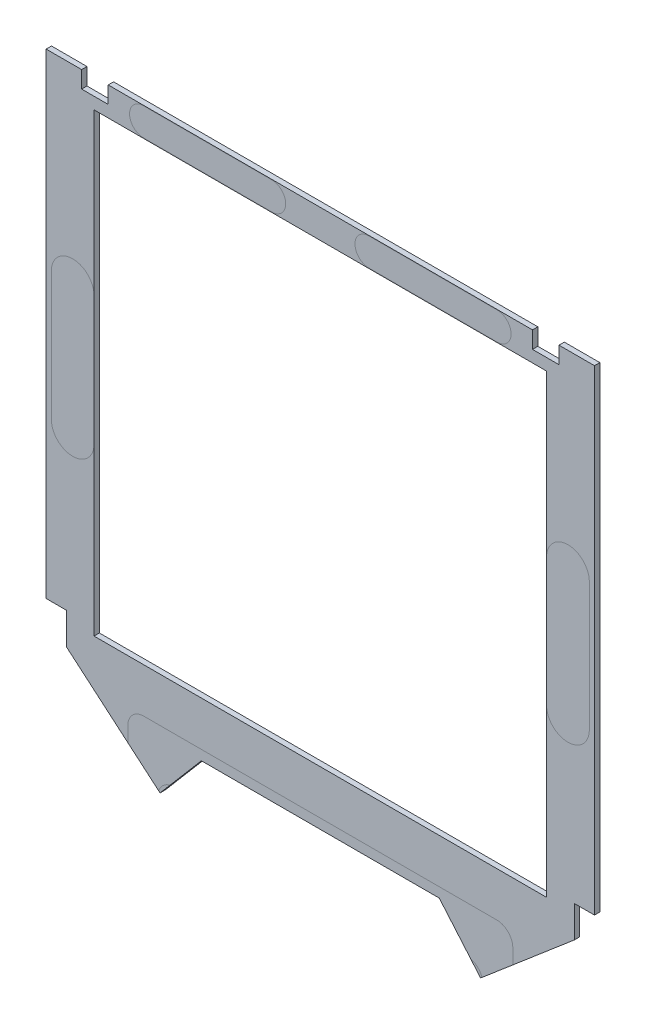
ISO-10303-21;
HEADER;
FILE_DESCRIPTION(('STEP AP214'),'2;1');
FILE_NAME('part.step','',(''),(''),'','','');
FILE_SCHEMA(('AUTOMOTIVE_DESIGN { 1 0 10303 214 1 1 1 1 }'));
ENDSEC;
DATA;
#1=APPLICATION_CONTEXT('core data for automotive mechanical design processes');
#2=APPLICATION_PROTOCOL_DEFINITION('international standard','automotive_design',2000,#1);
#3=PRODUCT_CONTEXT('',#1,'mechanical');
#4=PRODUCT('Part','Part','',(#3));
#5=PRODUCT_RELATED_PRODUCT_CATEGORY('part','',(#4));
#6=PRODUCT_DEFINITION_FORMATION('','',#4);
#7=PRODUCT_DEFINITION_CONTEXT('part definition',#1,'design');
#8=PRODUCT_DEFINITION('design','',#6,#7);
#9=PRODUCT_DEFINITION_SHAPE('','',#8);
#10=(LENGTH_UNIT() NAMED_UNIT(*) SI_UNIT(.MILLI.,.METRE.));
#11=(NAMED_UNIT(*) PLANE_ANGLE_UNIT() SI_UNIT($,.RADIAN.));
#12=(NAMED_UNIT(*) SI_UNIT($,.STERADIAN.) SOLID_ANGLE_UNIT());
#13=UNCERTAINTY_MEASURE_WITH_UNIT(LENGTH_MEASURE(1.E-05),#10,'distance_accuracy_value','');
#14=(GEOMETRIC_REPRESENTATION_CONTEXT(3) GLOBAL_UNCERTAINTY_ASSIGNED_CONTEXT((#13)) GLOBAL_UNIT_ASSIGNED_CONTEXT((#10,
#11,#12)) REPRESENTATION_CONTEXT('',''));
#15=CARTESIAN_POINT('',(0.,0.,0.));
#16=DIRECTION('',(0.,0.,1.));
#17=DIRECTION('',(1.,0.,0.));
#18=AXIS2_PLACEMENT_3D('',#15,#16,#17);
#19=CARTESIAN_POINT('',(0.,0.,-7.34889999998428));
#20=DIRECTION('',(0.,0.,1.));
#21=DIRECTION('',(1.,0.,0.));
#22=AXIS2_PLACEMENT_3D('',#19,#20,#21);
#23=PLANE('',#22);
#24=CARTESIAN_POINT('',(73.5235360525918,97.6630000000027,-7.34889999998428));
#25=DIRECTION('',(0.,0.,1.));
#26=DIRECTION('',(1.,0.,0.));
#27=AXIS2_PLACEMENT_3D('',#24,#25,#26);
#28=CIRCLE('',#27,6.34999999999999);
#29=CARTESIAN_POINT('',(79.8735360525918,97.6630000000027,-7.34889999998428));
#30=VERTEX_POINT('',#29);
#31=CARTESIAN_POINT('',(73.5235360525918,91.3130000000027,-7.34889999998428));
#32=VERTEX_POINT('',#31);
#33=EDGE_CURVE('E519',#30,#32,#28,.F.);
#34=ORIENTED_EDGE('',*,*,#33,.T.);
#35=CARTESIAN_POINT('',(73.5235360525918,97.6630000000027,-7.34889999998428));
#36=DIRECTION('',(0.,0.,1.));
#37=DIRECTION('',(1.,0.,0.));
#38=AXIS2_PLACEMENT_3D('',#35,#36,#37);
#39=CIRCLE('',#38,6.34999999999999);
#40=CARTESIAN_POINT('',(67.183,97.3164418291525,-7.34889999998428));
#41=VERTEX_POINT('',#40);
#42=EDGE_CURVE('E522',#32,#41,#39,.F.);
#43=ORIENTED_EDGE('',*,*,#42,.T.);
#44=DIRECTION('',(0.,1.,0.));
#45=VECTOR('',#44,1.);
#46=CARTESIAN_POINT('',(67.1829999999999,183.578500012225,-7.34889999998428));
#47=LINE('',#46,#45);
#48=CARTESIAN_POINT('',(67.183,48.2600000000018,-7.34889999998428));
#49=VERTEX_POINT('',#48);
#50=EDGE_CURVE('E302',#49,#41,#47,.T.);
#51=ORIENTED_EDGE('',*,*,#50,.F.);
#52=DIRECTION('',(1.,0.,0.));
#53=VECTOR('',#52,1.);
#54=CARTESIAN_POINT('',(-67.183,48.2600000000018,-7.34889999998428));
#55=LINE('',#54,#53);
#56=CARTESIAN_POINT('',(-67.183,48.2600000000018,-7.34889999998428));
#57=VERTEX_POINT('',#56);
#58=EDGE_CURVE('E322',#57,#49,#55,.T.);
#59=ORIENTED_EDGE('',*,*,#58,.F.);
#60=DIRECTION('',(0.,-1.,0.));
#61=VECTOR('',#60,1.);
#62=CARTESIAN_POINT('',(-67.183,183.578500012225,-7.34889999998428));
#63=LINE('',#62,#61);
#64=CARTESIAN_POINT('',(-67.183,97.3164418291369,-7.34889999998428));
#65=VERTEX_POINT('',#64);
#66=EDGE_CURVE('E317',#65,#57,#63,.T.);
#67=ORIENTED_EDGE('',*,*,#66,.F.);
#68=CARTESIAN_POINT('',(-73.523536052591,97.6630000000027,-7.34889999998428));
#69=DIRECTION('',(0.,0.,1.));
#70=DIRECTION('',(1.,0.,0.));
#71=AXIS2_PLACEMENT_3D('',#68,#69,#70);
#72=CIRCLE('',#71,6.34999999999999);
#73=CARTESIAN_POINT('',(-73.523536052591,91.3130000000027,-7.34889999998428));
#74=VERTEX_POINT('',#73);
#75=EDGE_CURVE('E489',#65,#74,#72,.F.);
#76=ORIENTED_EDGE('',*,*,#75,.T.);
#77=CARTESIAN_POINT('',(-73.523536052591,97.6630000000027,-7.34889999998428));
#78=DIRECTION('',(0.,0.,1.));
#79=DIRECTION('',(1.,0.,0.));
#80=AXIS2_PLACEMENT_3D('',#77,#78,#79);
#81=CIRCLE('',#80,6.34999999999999);
#82=CARTESIAN_POINT('',(-79.873536052591,97.6630000000027,-7.34889999998428));
#83=VERTEX_POINT('',#82);
#84=EDGE_CURVE('E493',#74,#83,#81,.F.);
#85=ORIENTED_EDGE('',*,*,#84,.T.);
#86=DIRECTION('',(0.,1.,0.));
#87=VECTOR('',#86,1.);
#88=CARTESIAN_POINT('',(-79.8735360525909,0.,-7.34889999998428));
#89=LINE('',#88,#87);
#90=CARTESIAN_POINT('',(-79.873536052591,135.763000000003,-7.34889999998428));
#91=VERTEX_POINT('',#90);
#92=EDGE_CURVE('E497',#83,#91,#89,.T.);
#93=ORIENTED_EDGE('',*,*,#92,.T.);
#94=CARTESIAN_POINT('',(-73.523536052591,135.763000000003,-7.34889999998428));
#95=DIRECTION('',(0.,0.,1.));
#96=DIRECTION('',(1.,0.,0.));
#97=AXIS2_PLACEMENT_3D('',#94,#95,#96);
#98=CIRCLE('',#97,6.34999999999999);
#99=CARTESIAN_POINT('',(-73.523536052591,142.113000000003,-7.34889999998428));
#100=VERTEX_POINT('',#99);
#101=EDGE_CURVE('E501',#91,#100,#98,.F.);
#102=ORIENTED_EDGE('',*,*,#101,.T.);
#103=CARTESIAN_POINT('',(-73.523536052591,135.763000000003,-7.34889999998428));
#104=DIRECTION('',(0.,0.,1.));
#105=DIRECTION('',(1.,0.,0.));
#106=AXIS2_PLACEMENT_3D('',#103,#104,#105);
#107=CIRCLE('',#106,6.34999999999999);
#108=CARTESIAN_POINT('',(-67.183,136.109558170868,-7.34889999998428));
#109=VERTEX_POINT('',#108);
#110=EDGE_CURVE('E505',#100,#109,#107,.F.);
#111=ORIENTED_EDGE('',*,*,#110,.T.);
#112=CARTESIAN_POINT('',(-67.183,183.578500012225,-7.34889999998428));
#113=VERTEX_POINT('',#112);
#114=EDGE_CURVE('E316',#113,#109,#63,.T.);
#115=ORIENTED_EDGE('',*,*,#114,.F.);
#116=DIRECTION('',(-1.,0.,0.));
#117=VECTOR('',#116,1.);
#118=CARTESIAN_POINT('',(-67.183,183.578500012225,-7.34889999998428));
#119=LINE('',#118,#117);
#120=CARTESIAN_POINT('',(67.1829999999999,183.578500012225,-7.34889999998428));
#121=VERTEX_POINT('',#120);
#122=EDGE_CURVE('E305',#121,#113,#119,.T.);
#123=ORIENTED_EDGE('',*,*,#122,.F.);
#124=CARTESIAN_POINT('',(67.183,136.109558170853,-7.34889999998428));
#125=VERTEX_POINT('',#124);
#126=EDGE_CURVE('E289',#125,#121,#47,.T.);
#127=ORIENTED_EDGE('',*,*,#126,.F.);
#128=CARTESIAN_POINT('',(73.5235360525918,135.763000000003,-7.34889999998428));
#129=DIRECTION('',(0.,0.,1.));
#130=DIRECTION('',(1.,0.,0.));
#131=AXIS2_PLACEMENT_3D('',#128,#129,#130);
#132=CIRCLE('',#131,6.34999999999999);
#133=CARTESIAN_POINT('',(73.5235360525918,142.113000000003,-7.34889999998428));
#134=VERTEX_POINT('',#133);
#135=EDGE_CURVE('E508',#125,#134,#132,.F.);
#136=ORIENTED_EDGE('',*,*,#135,.T.);
#137=CARTESIAN_POINT('',(73.5235360525918,135.763000000003,-7.34889999998428));
#138=DIRECTION('',(0.,0.,1.));
#139=DIRECTION('',(1.,0.,0.));
#140=AXIS2_PLACEMENT_3D('',#137,#138,#139);
#141=CIRCLE('',#140,6.34999999999999);
#142=CARTESIAN_POINT('',(79.8735360525918,135.763000000003,-7.34889999998428));
#143=VERTEX_POINT('',#142);
#144=EDGE_CURVE('E511',#134,#143,#141,.F.);
#145=ORIENTED_EDGE('',*,*,#144,.T.);
#146=DIRECTION('',(0.,-1.,0.));
#147=VECTOR('',#146,1.);
#148=CARTESIAN_POINT('',(79.8735360525918,0.,-7.34889999998428));
#149=LINE('',#148,#147);
#150=EDGE_CURVE('E515',#143,#30,#149,.T.);
#151=ORIENTED_EDGE('',*,*,#150,.T.);
#152=EDGE_LOOP('',(#34,#43,#51,#59,#67,#76,#85,#93,#102,#111,#115,#123,#127,#136,#145,#151));
#153=FACE_BOUND('',#152,.T.);
#154=CARTESIAN_POINT('',(52.3875000000004,30.2895000000029,-7.34889999998428));
#155=DIRECTION('',(0.,0.,1.));
#156=DIRECTION('',(1.,0.,0.));
#157=AXIS2_PLACEMENT_3D('',#154,#155,#156);
#158=CIRCLE('',#157,4.7625);
#159=CARTESIAN_POINT('',(52.3875000000004,35.0520000000029,-7.34889999998428));
#160=VERTEX_POINT('',#159);
#161=CARTESIAN_POINT('',(57.1500000000004,30.2895000000029,-7.34889999998428));
#162=VERTEX_POINT('',#161);
#163=EDGE_CURVE('E537',#160,#162,#158,.F.);
#164=ORIENTED_EDGE('',*,*,#163,.T.);
#165=DIRECTION('',(0.,-1.,0.));
#166=VECTOR('',#165,1.);
#167=CARTESIAN_POINT('',(57.1500000000004,0.,-7.34889999998428));
#168=LINE('',#167,#166);
#169=CARTESIAN_POINT('',(57.1500000000004,25.8628002587452,-7.34889999998428));
#170=VERTEX_POINT('',#169);
#171=EDGE_CURVE('E541',#162,#170,#168,.T.);
#172=ORIENTED_EDGE('',*,*,#171,.T.);
#173=DIRECTION('',(0.761488208276798,0.648178762885202,0.));
#174=VECTOR('',#173,1.);
#175=CARTESIAN_POINT('',(75.438,41.4295458587446,-7.34889999998428));
#176=LINE('',#175,#174);
#177=CARTESIAN_POINT('',(75.438,41.4295458587446,-7.34889999998428));
#178=VERTEX_POINT('',#177);
#179=EDGE_CURVE('E373',#170,#178,#176,.T.);
#180=ORIENTED_EDGE('',*,*,#179,.T.);
#181=DIRECTION('',(0.,1.,0.));
#182=VECTOR('',#181,1.);
#183=CARTESIAN_POINT('',(75.438,50.8000000000018,-7.34889999998428));
#184=LINE('',#183,#182);
#185=CARTESIAN_POINT('',(75.438,50.8000000000018,-7.34889999998428));
#186=VERTEX_POINT('',#185);
#187=EDGE_CURVE('E377',#178,#186,#184,.T.);
#188=ORIENTED_EDGE('',*,*,#187,.T.);
#189=DIRECTION('',(1.,0.,0.));
#190=VECTOR('',#189,1.);
#191=CARTESIAN_POINT('',(81.4070000000005,50.8000000000018,-7.34889999998428));
#192=LINE('',#191,#190);
#193=CARTESIAN_POINT('',(81.4070000000005,50.8000000000018,-7.34889999998428));
#194=VERTEX_POINT('',#193);
#195=EDGE_CURVE('E380',#186,#194,#192,.T.);
#196=ORIENTED_EDGE('',*,*,#195,.T.);
#197=DIRECTION('',(0.,1.,0.));
#198=VECTOR('',#197,1.);
#199=CARTESIAN_POINT('',(81.4070000000005,192.087500000002,-7.34889999998428));
#200=LINE('',#199,#198);
#201=CARTESIAN_POINT('',(81.4070000000005,192.087500000002,-7.34889999998428));
#202=VERTEX_POINT('',#201);
#203=EDGE_CURVE('E382',#194,#202,#200,.T.);
#204=ORIENTED_EDGE('',*,*,#203,.T.);
#205=DIRECTION('',(-1.,0.,0.));
#206=VECTOR('',#205,1.);
#207=CARTESIAN_POINT('',(70.866,192.087500000002,-7.34889999998428));
#208=LINE('',#207,#206);
#209=CARTESIAN_POINT('',(70.866,192.087500000002,-7.34889999998428));
#210=VERTEX_POINT('',#209);
#211=EDGE_CURVE('E384',#202,#210,#208,.T.);
#212=ORIENTED_EDGE('',*,*,#211,.T.);
#213=DIRECTION('',(0.,-1.,0.));
#214=VECTOR('',#213,1.);
#215=CARTESIAN_POINT('',(70.866,187.071000000002,-7.34889999998428));
#216=LINE('',#215,#214);
#217=CARTESIAN_POINT('',(70.866,187.071000000002,-7.34889999998428));
#218=VERTEX_POINT('',#217);
#219=EDGE_CURVE('E386',#210,#218,#216,.T.);
#220=ORIENTED_EDGE('',*,*,#219,.T.);
#221=DIRECTION('',(-1.,0.,0.));
#222=VECTOR('',#221,1.);
#223=CARTESIAN_POINT('',(62.9919999999999,187.071000000002,-7.34889999998428));
#224=LINE('',#223,#222);
#225=CARTESIAN_POINT('',(62.9919999999999,187.071000000002,-7.34889999998428));
#226=VERTEX_POINT('',#225);
#227=EDGE_CURVE('E388',#218,#226,#224,.T.);
#228=ORIENTED_EDGE('',*,*,#227,.T.);
#229=DIRECTION('',(0.,1.,0.));
#230=VECTOR('',#229,1.);
#231=CARTESIAN_POINT('',(62.9919999999999,192.087500000002,-7.34889999998428));
#232=LINE('',#231,#230);
#233=CARTESIAN_POINT('',(62.9919999999999,192.087500000002,-7.34889999998428));
#234=VERTEX_POINT('',#233);
#235=EDGE_CURVE('E338',#226,#234,#232,.T.);
#236=ORIENTED_EDGE('',*,*,#235,.T.);
#237=DIRECTION('',(-1.,0.,0.));
#238=VECTOR('',#237,1.);
#239=CARTESIAN_POINT('',(-62.992,192.087500000002,-7.34889999998428));
#240=LINE('',#239,#238);
#241=CARTESIAN_POINT('',(-62.992,192.087500000002,-7.34889999998428));
#242=VERTEX_POINT('',#241);
#243=EDGE_CURVE('E341',#234,#242,#240,.T.);
#244=ORIENTED_EDGE('',*,*,#243,.T.);
#245=DIRECTION('',(0.,-1.,0.));
#246=VECTOR('',#245,1.);
#247=CARTESIAN_POINT('',(-62.992,192.087500000002,-7.34889999998428));
#248=LINE('',#247,#246);
#249=CARTESIAN_POINT('',(-62.992,187.071000000002,-7.34889999998428));
#250=VERTEX_POINT('',#249);
#251=EDGE_CURVE('E344',#242,#250,#248,.T.);
#252=ORIENTED_EDGE('',*,*,#251,.T.);
#253=DIRECTION('',(-1.,0.,0.));
#254=VECTOR('',#253,1.);
#255=CARTESIAN_POINT('',(-62.992,187.071000000002,-7.34889999998428));
#256=LINE('',#255,#254);
#257=CARTESIAN_POINT('',(-70.866,187.071000000002,-7.34889999998428));
#258=VERTEX_POINT('',#257);
#259=EDGE_CURVE('E346',#250,#258,#256,.T.);
#260=ORIENTED_EDGE('',*,*,#259,.T.);
#261=DIRECTION('',(0.,1.,0.));
#262=VECTOR('',#261,1.);
#263=CARTESIAN_POINT('',(-70.866,187.071000000002,-7.34889999998428));
#264=LINE('',#263,#262);
#265=CARTESIAN_POINT('',(-70.866,192.087500000002,-7.34889999998428));
#266=VERTEX_POINT('',#265);
#267=EDGE_CURVE('E348',#258,#266,#264,.T.);
#268=ORIENTED_EDGE('',*,*,#267,.T.);
#269=DIRECTION('',(-1.,0.,0.));
#270=VECTOR('',#269,1.);
#271=CARTESIAN_POINT('',(-70.866,192.087500000002,-7.34889999998428));
#272=LINE('',#271,#270);
#273=CARTESIAN_POINT('',(-81.4070000000005,192.087500000002,-7.34889999998428));
#274=VERTEX_POINT('',#273);
#275=EDGE_CURVE('E350',#266,#274,#272,.T.);
#276=ORIENTED_EDGE('',*,*,#275,.T.);
#277=DIRECTION('',(0.,-1.,0.));
#278=VECTOR('',#277,1.);
#279=CARTESIAN_POINT('',(-81.4070000000005,192.087500000002,-7.34889999998428));
#280=LINE('',#279,#278);
#281=CARTESIAN_POINT('',(-81.4070000000005,50.8000000000018,-7.34889999998428));
#282=VERTEX_POINT('',#281);
#283=EDGE_CURVE('E352',#274,#282,#280,.T.);
#284=ORIENTED_EDGE('',*,*,#283,.T.);
#285=DIRECTION('',(1.,0.,0.));
#286=VECTOR('',#285,1.);
#287=CARTESIAN_POINT('',(-81.4070000000005,50.8000000000018,-7.34889999998428));
#288=LINE('',#287,#286);
#289=CARTESIAN_POINT('',(-75.438,50.8000000000018,-7.34889999998428));
#290=VERTEX_POINT('',#289);
#291=EDGE_CURVE('E354',#282,#290,#288,.T.);
#292=ORIENTED_EDGE('',*,*,#291,.T.);
#293=DIRECTION('',(0.,-1.,0.));
#294=VECTOR('',#293,1.);
#295=CARTESIAN_POINT('',(-75.438,50.8000000000018,-7.34889999998428));
#296=LINE('',#295,#294);
#297=CARTESIAN_POINT('',(-75.438,41.4295458587446,-7.34889999998428));
#298=VERTEX_POINT('',#297);
#299=EDGE_CURVE('E356',#290,#298,#296,.T.);
#300=ORIENTED_EDGE('',*,*,#299,.T.);
#301=DIRECTION('',(0.761488208276798,-0.648178762885202,0.));
#302=VECTOR('',#301,1.);
#303=CARTESIAN_POINT('',(-75.438,41.4295458587446,-7.34889999998428));
#304=LINE('',#303,#302);
#305=CARTESIAN_POINT('',(-57.1499999999996,25.8628002587445,-7.34889999998428));
#306=VERTEX_POINT('',#305);
#307=EDGE_CURVE('E359',#298,#306,#304,.T.);
#308=ORIENTED_EDGE('',*,*,#307,.T.);
#309=DIRECTION('',(0.,1.,0.));
#310=VECTOR('',#309,1.);
#311=CARTESIAN_POINT('',(-57.1499999999996,0.,-7.34889999998428));
#312=LINE('',#311,#310);
#313=CARTESIAN_POINT('',(-57.1499999999996,30.2895000000029,-7.34889999998428));
#314=VERTEX_POINT('',#313);
#315=EDGE_CURVE('E525',#306,#314,#312,.T.);
#316=ORIENTED_EDGE('',*,*,#315,.T.);
#317=CARTESIAN_POINT('',(-52.3874999999996,30.2895000000029,-7.34889999998428));
#318=DIRECTION('',(0.,0.,1.));
#319=DIRECTION('',(1.,0.,0.));
#320=AXIS2_PLACEMENT_3D('',#317,#318,#319);
#321=CIRCLE('',#320,4.7625);
#322=CARTESIAN_POINT('',(-52.3874999999996,35.0520000000029,-7.34889999998428));
#323=VERTEX_POINT('',#322);
#324=EDGE_CURVE('E529',#314,#323,#321,.F.);
#325=ORIENTED_EDGE('',*,*,#324,.T.);
#326=DIRECTION('',(1.,0.,0.));
#327=VECTOR('',#326,1.);
#328=CARTESIAN_POINT('',(0.,35.0520000000029,-7.34889999998428));
#329=LINE('',#328,#327);
#330=EDGE_CURVE('E533',#323,#160,#329,.T.);
#331=ORIENTED_EDGE('',*,*,#330,.T.);
#332=EDGE_LOOP('',(#164,#172,#180,#188,#196,#204,#212,#220,#228,#236,#244,#252,#260,#268,#276,
#284,#292,#300,#308,#316,#325,#331));
#333=FACE_BOUND('',#332,.T.);
#334=DIRECTION('',(1.,0.,0.));
#335=VECTOR('',#334,1.);
#336=CARTESIAN_POINT('',(0.,191.960500006114,-7.34889999998428));
#337=LINE('',#336,#335);
#338=CARTESIAN_POINT('',(14.4145000000004,191.960500006114,-7.34889999998428));
#339=VERTEX_POINT('',#338);
#340=CARTESIAN_POINT('',(52.5145000000004,191.960500006114,-7.34889999998428));
#341=VERTEX_POINT('',#340);
#342=EDGE_CURVE('E558',#339,#341,#337,.T.);
#343=ORIENTED_EDGE('',*,*,#342,.T.);
#344=CARTESIAN_POINT('',(52.5145000000004,187.833000006114,-7.34889999998428));
#345=DIRECTION('',(0.,0.,1.));
#346=DIRECTION('',(1.,0.,0.));
#347=AXIS2_PLACEMENT_3D('',#344,#345,#346);
#348=CIRCLE('',#347,4.12750000000003);
#349=CARTESIAN_POINT('',(52.5145000000004,183.705500006114,-7.34889999998428));
#350=VERTEX_POINT('',#349);
#351=EDGE_CURVE('E562',#341,#350,#348,.F.);
#352=ORIENTED_EDGE('',*,*,#351,.T.);
#353=DIRECTION('',(-1.,0.,0.));
#354=VECTOR('',#353,1.);
#355=CARTESIAN_POINT('',(0.,183.705500006114,-7.34889999998428));
#356=LINE('',#355,#354);
#357=CARTESIAN_POINT('',(14.4145000000004,183.705500006114,-7.34889999998428));
#358=VERTEX_POINT('',#357);
#359=EDGE_CURVE('E550',#350,#358,#356,.T.);
#360=ORIENTED_EDGE('',*,*,#359,.T.);
#361=CARTESIAN_POINT('',(14.4145000000004,187.833000006114,-7.34889999998428));
#362=DIRECTION('',(0.,0.,1.));
#363=DIRECTION('',(1.,0.,0.));
#364=AXIS2_PLACEMENT_3D('',#361,#362,#363);
#365=CIRCLE('',#364,4.12750000000003);
#366=EDGE_CURVE('E554',#358,#339,#365,.F.);
#367=ORIENTED_EDGE('',*,*,#366,.T.);
#368=EDGE_LOOP('',(#343,#352,#360,#367));
#369=FACE_BOUND('',#368,.T.);
#370=DIRECTION('',(-1.,0.,0.));
#371=VECTOR('',#370,1.);
#372=CARTESIAN_POINT('',(2.40890640776061E-12,183.705500006114,-7.34889999998428));
#373=LINE('',#372,#371);
#374=CARTESIAN_POINT('',(-14.4144999999997,183.705500006115,-7.34889999998428));
#375=VERTEX_POINT('',#374);
#376=CARTESIAN_POINT('',(-52.5144999999997,183.705500006115,-7.34889999998428));
#377=VERTEX_POINT('',#376);
#378=EDGE_CURVE('E49',#375,#377,#373,.T.);
#379=ORIENTED_EDGE('',*,*,#378,.T.);
#380=CARTESIAN_POINT('',(-52.5144999999996,187.833000006115,-7.34889999998428));
#381=DIRECTION('',(0.,0.,1.));
#382=DIRECTION('',(1.,0.,0.));
#383=AXIS2_PLACEMENT_3D('',#380,#381,#382);
#384=CIRCLE('',#383,4.12750000000003);
#385=CARTESIAN_POINT('',(-52.5144999999996,191.960500006115,-7.34889999998428));
#386=VERTEX_POINT('',#385);
#387=EDGE_CURVE('E11',#377,#386,#384,.F.);
#388=ORIENTED_EDGE('',*,*,#387,.T.);
#389=DIRECTION('',(1.,0.,0.));
#390=VECTOR('',#389,1.);
#391=CARTESIAN_POINT('',(2.51715315266157E-12,191.960500006114,-7.34889999998428));
#392=LINE('',#391,#390);
#393=CARTESIAN_POINT('',(-14.4144999999996,191.960500006115,-7.34889999998428));
#394=VERTEX_POINT('',#393);
#395=EDGE_CURVE('E43',#386,#394,#392,.T.);
#396=ORIENTED_EDGE('',*,*,#395,.T.);
#397=CARTESIAN_POINT('',(-14.4144999999996,187.833000006115,-7.34889999998428));
#398=DIRECTION('',(0.,0.,1.));
#399=DIRECTION('',(1.,0.,0.));
#400=AXIS2_PLACEMENT_3D('',#397,#398,#399);
#401=CIRCLE('',#400,4.12750000000003);
#402=EDGE_CURVE('E566',#394,#375,#401,.F.);
#403=ORIENTED_EDGE('',*,*,#402,.T.);
#404=EDGE_LOOP('',(#379,#388,#396,#403));
#405=FACE_BOUND('',#404,.T.);
#406=ADVANCED_FACE('F39',(#153,#333,#369,#405),#23,.T.);
#407=ORIENTED_EDGE('',*,*,#387,.F.);
#408=ORIENTED_EDGE('',*,*,#378,.F.);
#409=ORIENTED_EDGE('',*,*,#402,.F.);
#410=ORIENTED_EDGE('',*,*,#395,.F.);
#411=EDGE_LOOP('',(#407,#408,#409,#410));
#412=FACE_BOUND('',#411,.T.);
#413=ADVANCED_FACE('F575',(#412),#23,.T.);
#414=DIRECTION('',(0.6481787628852,0.761488208276801,0.));
#415=VECTOR('',#414,1.);
#416=CARTESIAN_POINT('',(-47.5844692421819,17.7206204776902,-7.34889999998428));
#417=LINE('',#416,#415);
#418=CARTESIAN_POINT('',(-47.5844692421819,17.7206204776902,-7.34889999998428));
#419=VERTEX_POINT('',#418);
#420=CARTESIAN_POINT('',(-44.6228394594577,21.1999787750635,-7.34889999998428));
#421=VERTEX_POINT('',#420);
#422=EDGE_CURVE('E364',#419,#421,#417,.T.);
#423=ORIENTED_EDGE('',*,*,#422,.T.);
#424=CARTESIAN_POINT('',(-43.4339999999996,16.5227000000026,-7.34889999998428));
#425=DIRECTION('',(0.,0.,1.));
#426=DIRECTION('',(1.,0.,0.));
#427=AXIS2_PLACEMENT_3D('',#424,#425,#426);
#428=CIRCLE('',#427,4.826);
#429=CARTESIAN_POINT('',(-48.0029201113253,18.0768058575051,-7.34889999998428));
#430=VERTEX_POINT('',#429);
#431=EDGE_CURVE('E547',#421,#430,#428,.T.);
#432=ORIENTED_EDGE('',*,*,#431,.T.);
#433=EDGE_CURVE('E358',#430,#419,#304,.T.);
#434=ORIENTED_EDGE('',*,*,#433,.T.);
#435=EDGE_LOOP('',(#423,#432,#434));
#436=FACE_BOUND('',#435,.T.);
#437=ADVANCED_FACE('F577',(#436),#23,.T.);
#438=CARTESIAN_POINT('',(47.5844692421819,17.7206204776902,-7.34889999998428));
#439=VERTEX_POINT('',#438);
#440=CARTESIAN_POINT('',(48.0029201113255,18.0768058575052,-7.34889999998428));
#441=VERTEX_POINT('',#440);
#442=EDGE_CURVE('E374',#439,#441,#176,.T.);
#443=ORIENTED_EDGE('',*,*,#442,.T.);
#444=CARTESIAN_POINT('',(43.4339999999998,16.522700000002,-7.34889999998428));
#445=DIRECTION('',(0.,0.,1.));
#446=DIRECTION('',(1.,0.,0.));
#447=AXIS2_PLACEMENT_3D('',#444,#445,#446);
#448=CIRCLE('',#447,4.82600000000018);
#449=CARTESIAN_POINT('',(44.6228394594581,21.1999787750631,-7.34889999998428));
#450=VERTEX_POINT('',#449);
#451=EDGE_CURVE('E544',#441,#450,#448,.T.);
#452=ORIENTED_EDGE('',*,*,#451,.T.);
#453=DIRECTION('',(0.648178762885203,-0.761488208276798,0.));
#454=VECTOR('',#453,1.);
#455=CARTESIAN_POINT('',(47.5844692421819,17.7206204776902,-7.34889999998428));
#456=LINE('',#455,#454);
#457=EDGE_CURVE('E369',#450,#439,#456,.T.);
#458=ORIENTED_EDGE('',*,*,#457,.T.);
#459=EDGE_LOOP('',(#443,#452,#458));
#460=FACE_BOUND('',#459,.T.);
#461=ADVANCED_FACE('F583',(#460),#23,.T.);
#462=ORIENTED_EDGE('',*,*,#351,.F.);
#463=ORIENTED_EDGE('',*,*,#342,.F.);
#464=ORIENTED_EDGE('',*,*,#366,.F.);
#465=ORIENTED_EDGE('',*,*,#359,.F.);
#466=EDGE_LOOP('',(#462,#463,#464,#465));
#467=FACE_BOUND('',#466,.T.);
#468=ADVANCED_FACE('F746',(#467),#23,.T.);
#469=ORIENTED_EDGE('',*,*,#431,.F.);
#470=CARTESIAN_POINT('',(-35.3183541927903,32.131000000002,-7.34889999998428));
#471=VERTEX_POINT('',#470);
#472=EDGE_CURVE('E362',#421,#471,#417,.T.);
#473=ORIENTED_EDGE('',*,*,#472,.T.);
#474=DIRECTION('',(1.,0.,0.));
#475=VECTOR('',#474,1.);
#476=CARTESIAN_POINT('',(35.3183541927902,32.131000000002,-7.34889999998428));
#477=LINE('',#476,#475);
#478=CARTESIAN_POINT('',(35.3183541927902,32.131000000002,-7.34889999998428));
#479=VERTEX_POINT('',#478);
#480=EDGE_CURVE('E367',#471,#479,#477,.T.);
#481=ORIENTED_EDGE('',*,*,#480,.T.);
#482=EDGE_CURVE('E370',#479,#450,#456,.T.);
#483=ORIENTED_EDGE('',*,*,#482,.T.);
#484=ORIENTED_EDGE('',*,*,#451,.F.);
#485=EDGE_CURVE('E378',#441,#170,#176,.T.);
#486=ORIENTED_EDGE('',*,*,#485,.T.);
#487=ORIENTED_EDGE('',*,*,#171,.F.);
#488=ORIENTED_EDGE('',*,*,#163,.F.);
#489=ORIENTED_EDGE('',*,*,#330,.F.);
#490=ORIENTED_EDGE('',*,*,#324,.F.);
#491=ORIENTED_EDGE('',*,*,#315,.F.);
#492=EDGE_CURVE('E363',#306,#430,#304,.T.);
#493=ORIENTED_EDGE('',*,*,#492,.T.);
#494=EDGE_LOOP('',(#469,#473,#481,#483,#484,#486,#487,#488,#489,#490,#491,#493));
#495=FACE_BOUND('',#494,.T.);
#496=ADVANCED_FACE('F742',(#495),#23,.T.);
#497=ORIENTED_EDGE('',*,*,#42,.F.);
#498=ORIENTED_EDGE('',*,*,#33,.F.);
#499=ORIENTED_EDGE('',*,*,#150,.F.);
#500=ORIENTED_EDGE('',*,*,#144,.F.);
#501=ORIENTED_EDGE('',*,*,#135,.F.);
#502=EDGE_CURVE('E296',#41,#125,#47,.T.);
#503=ORIENTED_EDGE('',*,*,#502,.F.);
#504=EDGE_LOOP('',(#497,#498,#499,#500,#501,#503));
#505=FACE_BOUND('',#504,.T.);
#506=ADVANCED_FACE('F590',(#505),#23,.T.);
#507=ORIENTED_EDGE('',*,*,#110,.F.);
#508=ORIENTED_EDGE('',*,*,#101,.F.);
#509=ORIENTED_EDGE('',*,*,#92,.F.);
#510=ORIENTED_EDGE('',*,*,#84,.F.);
#511=ORIENTED_EDGE('',*,*,#75,.F.);
#512=EDGE_CURVE('E319',#109,#65,#63,.T.);
#513=ORIENTED_EDGE('',*,*,#512,.F.);
#514=EDGE_LOOP('',(#507,#508,#509,#510,#511,#513));
#515=FACE_BOUND('',#514,.T.);
#516=ADVANCED_FACE('F585',(#515),#23,.T.);
#517=CARTESIAN_POINT('',(0.,0.,-8.9363999999843));
#518=DIRECTION('',(0.,0.,1.));
#519=DIRECTION('',(1.,0.,0.));
#520=AXIS2_PLACEMENT_3D('',#517,#518,#519);
#521=PLANE('',#520);
#522=DIRECTION('',(0.,1.,0.));
#523=VECTOR('',#522,1.);
#524=CARTESIAN_POINT('',(62.9919999999999,192.087500000002,-8.9363999999843));
#525=LINE('',#524,#523);
#526=CARTESIAN_POINT('',(62.9919999999999,187.071000000002,-8.9363999999843));
#527=VERTEX_POINT('',#526);
#528=CARTESIAN_POINT('',(62.9919999999999,192.087500000002,-8.9363999999843));
#529=VERTEX_POINT('',#528);
#530=EDGE_CURVE('E309',#527,#529,#525,.T.);
#531=ORIENTED_EDGE('',*,*,#530,.F.);
#532=DIRECTION('',(-1.,0.,0.));
#533=VECTOR('',#532,1.);
#534=CARTESIAN_POINT('',(62.9919999999999,187.071000000002,-8.9363999999843));
#535=LINE('',#534,#533);
#536=CARTESIAN_POINT('',(70.866,187.071000000002,-8.9363999999843));
#537=VERTEX_POINT('',#536);
#538=EDGE_CURVE('E342',#537,#527,#535,.T.);
#539=ORIENTED_EDGE('',*,*,#538,.F.);
#540=DIRECTION('',(0.,-1.,0.));
#541=VECTOR('',#540,1.);
#542=CARTESIAN_POINT('',(70.866,187.071000000002,-8.9363999999843));
#543=LINE('',#542,#541);
#544=CARTESIAN_POINT('',(70.866,192.087500000002,-8.9363999999843));
#545=VERTEX_POINT('',#544);
#546=EDGE_CURVE('E427',#545,#537,#543,.T.);
#547=ORIENTED_EDGE('',*,*,#546,.F.);
#548=DIRECTION('',(-1.,0.,0.));
#549=VECTOR('',#548,1.);
#550=CARTESIAN_POINT('',(70.866,192.087500000002,-8.9363999999843));
#551=LINE('',#550,#549);
#552=CARTESIAN_POINT('',(81.4070000000005,192.087500000002,-8.9363999999843));
#553=VERTEX_POINT('',#552);
#554=EDGE_CURVE('E425',#553,#545,#551,.T.);
#555=ORIENTED_EDGE('',*,*,#554,.F.);
#556=DIRECTION('',(0.,1.,0.));
#557=VECTOR('',#556,1.);
#558=CARTESIAN_POINT('',(81.4070000000005,192.087500000002,-8.9363999999843));
#559=LINE('',#558,#557);
#560=CARTESIAN_POINT('',(81.4070000000005,50.8000000000018,-8.9363999999843));
#561=VERTEX_POINT('',#560);
#562=EDGE_CURVE('E423',#561,#553,#559,.T.);
#563=ORIENTED_EDGE('',*,*,#562,.F.);
#564=DIRECTION('',(1.,0.,0.));
#565=VECTOR('',#564,1.);
#566=CARTESIAN_POINT('',(81.4070000000005,50.8000000000018,-8.9363999999843));
#567=LINE('',#566,#565);
#568=CARTESIAN_POINT('',(75.438,50.8000000000018,-8.9363999999843));
#569=VERTEX_POINT('',#568);
#570=EDGE_CURVE('E421',#569,#561,#567,.T.);
#571=ORIENTED_EDGE('',*,*,#570,.F.);
#572=DIRECTION('',(0.,1.,0.));
#573=VECTOR('',#572,1.);
#574=CARTESIAN_POINT('',(75.438,50.8000000000018,-8.9363999999843));
#575=LINE('',#574,#573);
#576=CARTESIAN_POINT('',(75.438,41.4295458587446,-8.9363999999843));
#577=VERTEX_POINT('',#576);
#578=EDGE_CURVE('E419',#577,#569,#575,.T.);
#579=ORIENTED_EDGE('',*,*,#578,.F.);
#580=DIRECTION('',(0.761488208276798,0.648178762885202,0.));
#581=VECTOR('',#580,1.);
#582=CARTESIAN_POINT('',(75.438,41.4295458587446,-8.9363999999843));
#583=LINE('',#582,#581);
#584=CARTESIAN_POINT('',(47.5844692421819,17.7206204776902,-8.9363999999843));
#585=VERTEX_POINT('',#584);
#586=EDGE_CURVE('E417',#585,#577,#583,.T.);
#587=ORIENTED_EDGE('',*,*,#586,.F.);
#588=DIRECTION('',(0.648178762885203,-0.761488208276798,0.));
#589=VECTOR('',#588,1.);
#590=CARTESIAN_POINT('',(47.5844692421819,17.7206204776902,-8.9363999999843));
#591=LINE('',#590,#589);
#592=CARTESIAN_POINT('',(35.3183541927902,32.131000000002,-8.9363999999843));
#593=VERTEX_POINT('',#592);
#594=EDGE_CURVE('E415',#593,#585,#591,.T.);
#595=ORIENTED_EDGE('',*,*,#594,.F.);
#596=DIRECTION('',(1.,0.,0.));
#597=VECTOR('',#596,1.);
#598=CARTESIAN_POINT('',(35.3183541927902,32.131000000002,-8.9363999999843));
#599=LINE('',#598,#597);
#600=CARTESIAN_POINT('',(-35.3183541927903,32.131000000002,-8.9363999999843));
#601=VERTEX_POINT('',#600);
#602=EDGE_CURVE('E413',#601,#593,#599,.T.);
#603=ORIENTED_EDGE('',*,*,#602,.F.);
#604=DIRECTION('',(0.6481787628852,0.761488208276801,0.));
#605=VECTOR('',#604,1.);
#606=CARTESIAN_POINT('',(-47.5844692421819,17.7206204776902,-8.9363999999843));
#607=LINE('',#606,#605);
#608=CARTESIAN_POINT('',(-47.5844692421819,17.7206204776902,-8.9363999999843));
#609=VERTEX_POINT('',#608);
#610=EDGE_CURVE('E411',#609,#601,#607,.T.);
#611=ORIENTED_EDGE('',*,*,#610,.F.);
#612=DIRECTION('',(0.761488208276798,-0.648178762885202,0.));
#613=VECTOR('',#612,1.);
#614=CARTESIAN_POINT('',(-75.438,41.4295458587446,-8.9363999999843));
#615=LINE('',#614,#613);
#616=CARTESIAN_POINT('',(-75.438,41.4295458587446,-8.9363999999843));
#617=VERTEX_POINT('',#616);
#618=EDGE_CURVE('E409',#617,#609,#615,.T.);
#619=ORIENTED_EDGE('',*,*,#618,.F.);
#620=DIRECTION('',(0.,-1.,0.));
#621=VECTOR('',#620,1.);
#622=CARTESIAN_POINT('',(-75.438,50.8000000000018,-8.9363999999843));
#623=LINE('',#622,#621);
#624=CARTESIAN_POINT('',(-75.438,50.8000000000018,-8.9363999999843));
#625=VERTEX_POINT('',#624);
#626=EDGE_CURVE('E407',#625,#617,#623,.T.);
#627=ORIENTED_EDGE('',*,*,#626,.F.);
#628=DIRECTION('',(1.,0.,0.));
#629=VECTOR('',#628,1.);
#630=CARTESIAN_POINT('',(-81.4070000000005,50.8000000000018,-8.9363999999843));
#631=LINE('',#630,#629);
#632=CARTESIAN_POINT('',(-81.4070000000005,50.8000000000018,-8.9363999999843));
#633=VERTEX_POINT('',#632);
#634=EDGE_CURVE('E405',#633,#625,#631,.T.);
#635=ORIENTED_EDGE('',*,*,#634,.F.);
#636=DIRECTION('',(0.,-1.,0.));
#637=VECTOR('',#636,1.);
#638=CARTESIAN_POINT('',(-81.4070000000005,192.087500000002,-8.9363999999843));
#639=LINE('',#638,#637);
#640=CARTESIAN_POINT('',(-81.4070000000005,192.087500000002,-8.9363999999843));
#641=VERTEX_POINT('',#640);
#642=EDGE_CURVE('E403',#641,#633,#639,.T.);
#643=ORIENTED_EDGE('',*,*,#642,.F.);
#644=DIRECTION('',(-1.,0.,0.));
#645=VECTOR('',#644,1.);
#646=CARTESIAN_POINT('',(-70.866,192.087500000002,-8.9363999999843));
#647=LINE('',#646,#645);
#648=CARTESIAN_POINT('',(-70.866,192.087500000002,-8.9363999999843));
#649=VERTEX_POINT('',#648);
#650=EDGE_CURVE('E401',#649,#641,#647,.T.);
#651=ORIENTED_EDGE('',*,*,#650,.F.);
#652=DIRECTION('',(0.,1.,0.));
#653=VECTOR('',#652,1.);
#654=CARTESIAN_POINT('',(-70.866,187.071000000002,-8.9363999999843));
#655=LINE('',#654,#653);
#656=CARTESIAN_POINT('',(-70.866,187.071000000002,-8.9363999999843));
#657=VERTEX_POINT('',#656);
#658=EDGE_CURVE('E399',#657,#649,#655,.T.);
#659=ORIENTED_EDGE('',*,*,#658,.F.);
#660=DIRECTION('',(-1.,0.,0.));
#661=VECTOR('',#660,1.);
#662=CARTESIAN_POINT('',(-62.992,187.071000000002,-8.9363999999843));
#663=LINE('',#662,#661);
#664=CARTESIAN_POINT('',(-62.992,187.071000000002,-8.9363999999843));
#665=VERTEX_POINT('',#664);
#666=EDGE_CURVE('E397',#665,#657,#663,.T.);
#667=ORIENTED_EDGE('',*,*,#666,.F.);
#668=DIRECTION('',(0.,-1.,0.));
#669=VECTOR('',#668,1.);
#670=CARTESIAN_POINT('',(-62.992,192.087500000002,-8.9363999999843));
#671=LINE('',#670,#669);
#672=CARTESIAN_POINT('',(-62.992,192.087500000002,-8.9363999999843));
#673=VERTEX_POINT('',#672);
#674=EDGE_CURVE('E395',#673,#665,#671,.T.);
#675=ORIENTED_EDGE('',*,*,#674,.F.);
#676=DIRECTION('',(-1.,0.,0.));
#677=VECTOR('',#676,1.);
#678=CARTESIAN_POINT('',(-62.992,192.087500000002,-8.9363999999843));
#679=LINE('',#678,#677);
#680=EDGE_CURVE('E393',#529,#673,#679,.T.);
#681=ORIENTED_EDGE('',*,*,#680,.F.);
#682=EDGE_LOOP('',(#531,#539,#547,#555,#563,#571,#579,#587,#595,#603,#611,#619,#627,#635,#643,
#651,#659,#667,#675,#681));
#683=FACE_BOUND('',#682,.T.);
#684=DIRECTION('',(0.,1.,0.));
#685=VECTOR('',#684,1.);
#686=CARTESIAN_POINT('',(67.1829999999999,183.578500012225,-8.9363999999843));
#687=LINE('',#686,#685);
#688=CARTESIAN_POINT('',(67.183,48.2600000000018,-8.9363999999843));
#689=VERTEX_POINT('',#688);
#690=CARTESIAN_POINT('',(67.1829999999999,183.578500012225,-8.9363999999843));
#691=VERTEX_POINT('',#690);
#692=EDGE_CURVE('E325',#689,#691,#687,.T.);
#693=ORIENTED_EDGE('',*,*,#692,.T.);
#694=DIRECTION('',(-1.,0.,0.));
#695=VECTOR('',#694,1.);
#696=CARTESIAN_POINT('',(-67.183,183.578500012225,-8.9363999999843));
#697=LINE('',#696,#695);
#698=CARTESIAN_POINT('',(-67.183,183.578500012225,-8.9363999999843));
#699=VERTEX_POINT('',#698);
#700=EDGE_CURVE('E308',#691,#699,#697,.T.);
#701=ORIENTED_EDGE('',*,*,#700,.T.);
#702=DIRECTION('',(0.,-1.,0.));
#703=VECTOR('',#702,1.);
#704=CARTESIAN_POINT('',(-67.183,183.578500012225,-8.9363999999843));
#705=LINE('',#704,#703);
#706=CARTESIAN_POINT('',(-67.183,48.2600000000018,-8.9363999999843));
#707=VERTEX_POINT('',#706);
#708=EDGE_CURVE('E328',#699,#707,#705,.T.);
#709=ORIENTED_EDGE('',*,*,#708,.T.);
#710=DIRECTION('',(1.,0.,0.));
#711=VECTOR('',#710,1.);
#712=CARTESIAN_POINT('',(-67.183,48.2600000000018,-8.9363999999843));
#713=LINE('',#712,#711);
#714=EDGE_CURVE('E300',#707,#689,#713,.T.);
#715=ORIENTED_EDGE('',*,*,#714,.T.);
#716=EDGE_LOOP('',(#693,#701,#709,#715));
#717=FACE_BOUND('',#716,.T.);
#718=ADVANCED_FACE('F589',(#683,#717),#521,.F.);
#719=CARTESIAN_POINT('',(62.9919999999999,192.087500000002,-7.34889999998428));
#720=DIRECTION('',(-1.,0.,0.));
#721=DIRECTION('',(0.,0.,1.));
#722=AXIS2_PLACEMENT_3D('',#719,#720,#721);
#723=PLANE('',#722);
#724=ORIENTED_EDGE('',*,*,#530,.T.);
#725=DIRECTION('',(0.,0.,-1.));
#726=VECTOR('',#725,1.);
#727=CARTESIAN_POINT('',(62.9919999999999,192.087500000002,-7.34889999998428));
#728=LINE('',#727,#726);
#729=EDGE_CURVE('E486',#234,#529,#728,.T.);
#730=ORIENTED_EDGE('',*,*,#729,.F.);
#731=ORIENTED_EDGE('',*,*,#235,.F.);
#732=DIRECTION('',(0.,0.,-1.));
#733=VECTOR('',#732,1.);
#734=CARTESIAN_POINT('',(62.9919999999999,187.071000000002,-7.34889999998428));
#735=LINE('',#734,#733);
#736=EDGE_CURVE('E390',#226,#527,#735,.T.);
#737=ORIENTED_EDGE('',*,*,#736,.T.);
#738=EDGE_LOOP('',(#724,#730,#731,#737));
#739=FACE_BOUND('',#738,.T.);
#740=ADVANCED_FACE('F41',(#739),#723,.F.);
#741=CARTESIAN_POINT('',(-62.992,192.087500000002,-7.34889999998428));
#742=DIRECTION('',(0.,-1.,0.));
#743=DIRECTION('',(1.,0.,0.));
#744=AXIS2_PLACEMENT_3D('',#741,#742,#743);
#745=PLANE('',#744);
#746=ORIENTED_EDGE('',*,*,#680,.T.);
#747=DIRECTION('',(0.,0.,-1.));
#748=VECTOR('',#747,1.);
#749=CARTESIAN_POINT('',(-62.992,192.087500000002,-7.34889999998428));
#750=LINE('',#749,#748);
#751=EDGE_CURVE('E483',#242,#673,#750,.T.);
#752=ORIENTED_EDGE('',*,*,#751,.F.);
#753=ORIENTED_EDGE('',*,*,#243,.F.);
#754=ORIENTED_EDGE('',*,*,#729,.T.);
#755=EDGE_LOOP('',(#746,#752,#753,#754));
#756=FACE_BOUND('',#755,.T.);
#757=ADVANCED_FACE('F666',(#756),#745,.F.);
#758=CARTESIAN_POINT('',(-62.992,192.087500000002,-7.34889999998428));
#759=DIRECTION('',(1.,0.,0.));
#760=DIRECTION('',(0.,0.,-1.));
#761=AXIS2_PLACEMENT_3D('',#758,#759,#760);
#762=PLANE('',#761);
#763=ORIENTED_EDGE('',*,*,#674,.T.);
#764=DIRECTION('',(0.,0.,-1.));
#765=VECTOR('',#764,1.);
#766=CARTESIAN_POINT('',(-62.992,187.071000000002,-7.34889999998428));
#767=LINE('',#766,#765);
#768=EDGE_CURVE('E480',#250,#665,#767,.T.);
#769=ORIENTED_EDGE('',*,*,#768,.F.);
#770=ORIENTED_EDGE('',*,*,#251,.F.);
#771=ORIENTED_EDGE('',*,*,#751,.T.);
#772=EDGE_LOOP('',(#763,#769,#770,#771));
#773=FACE_BOUND('',#772,.T.);
#774=ADVANCED_FACE('F663',(#773),#762,.F.);
#775=CARTESIAN_POINT('',(-62.992,187.071000000002,-7.34889999998428));
#776=DIRECTION('',(0.,-1.,0.));
#777=DIRECTION('',(1.,0.,0.));
#778=AXIS2_PLACEMENT_3D('',#775,#776,#777);
#779=PLANE('',#778);
#780=ORIENTED_EDGE('',*,*,#666,.T.);
#781=DIRECTION('',(0.,0.,-1.));
#782=VECTOR('',#781,1.);
#783=CARTESIAN_POINT('',(-70.866,187.071000000002,-7.34889999998428));
#784=LINE('',#783,#782);
#785=EDGE_CURVE('E477',#258,#657,#784,.T.);
#786=ORIENTED_EDGE('',*,*,#785,.F.);
#787=ORIENTED_EDGE('',*,*,#259,.F.);
#788=ORIENTED_EDGE('',*,*,#768,.T.);
#789=EDGE_LOOP('',(#780,#786,#787,#788));
#790=FACE_BOUND('',#789,.T.);
#791=ADVANCED_FACE('F659',(#790),#779,.F.);
#792=CARTESIAN_POINT('',(-70.866,187.071000000002,-7.34889999998428));
#793=DIRECTION('',(-1.,0.,0.));
#794=DIRECTION('',(0.,0.,1.));
#795=AXIS2_PLACEMENT_3D('',#792,#793,#794);
#796=PLANE('',#795);
#797=ORIENTED_EDGE('',*,*,#658,.T.);
#798=DIRECTION('',(0.,0.,-1.));
#799=VECTOR('',#798,1.);
#800=CARTESIAN_POINT('',(-70.866,192.087500000002,-7.34889999998428));
#801=LINE('',#800,#799);
#802=EDGE_CURVE('E474',#266,#649,#801,.T.);
#803=ORIENTED_EDGE('',*,*,#802,.F.);
#804=ORIENTED_EDGE('',*,*,#267,.F.);
#805=ORIENTED_EDGE('',*,*,#785,.T.);
#806=EDGE_LOOP('',(#797,#803,#804,#805));
#807=FACE_BOUND('',#806,.T.);
#808=ADVANCED_FACE('F655',(#807),#796,.F.);
#809=CARTESIAN_POINT('',(-70.866,192.087500000002,-7.34889999998428));
#810=DIRECTION('',(0.,-1.,0.));
#811=DIRECTION('',(0.,0.,-1.));
#812=AXIS2_PLACEMENT_3D('',#809,#810,#811);
#813=PLANE('',#812);
#814=ORIENTED_EDGE('',*,*,#650,.T.);
#815=DIRECTION('',(0.,0.,-1.));
#816=VECTOR('',#815,1.);
#817=CARTESIAN_POINT('',(-81.4070000000005,192.087500000002,-7.34889999998428));
#818=LINE('',#817,#816);
#819=EDGE_CURVE('E471',#274,#641,#818,.T.);
#820=ORIENTED_EDGE('',*,*,#819,.F.);
#821=ORIENTED_EDGE('',*,*,#275,.F.);
#822=ORIENTED_EDGE('',*,*,#802,.T.);
#823=EDGE_LOOP('',(#814,#820,#821,#822));
#824=FACE_BOUND('',#823,.T.);
#825=ADVANCED_FACE('F651',(#824),#813,.F.);
#826=CARTESIAN_POINT('',(-81.4070000000005,192.087500000002,-7.34889999998428));
#827=DIRECTION('',(1.,0.,0.));
#828=DIRECTION('',(0.,1.,0.));
#829=AXIS2_PLACEMENT_3D('',#826,#827,#828);
#830=PLANE('',#829);
#831=ORIENTED_EDGE('',*,*,#642,.T.);
#832=DIRECTION('',(0.,0.,-1.));
#833=VECTOR('',#832,1.);
#834=CARTESIAN_POINT('',(-81.4070000000005,50.8000000000018,-7.34889999998428));
#835=LINE('',#834,#833);
#836=EDGE_CURVE('E468',#282,#633,#835,.T.);
#837=ORIENTED_EDGE('',*,*,#836,.F.);
#838=ORIENTED_EDGE('',*,*,#283,.F.);
#839=ORIENTED_EDGE('',*,*,#819,.T.);
#840=EDGE_LOOP('',(#831,#837,#838,#839));
#841=FACE_BOUND('',#840,.T.);
#842=ADVANCED_FACE('F647',(#841),#830,.F.);
#843=CARTESIAN_POINT('',(-81.4070000000005,50.8000000000018,-7.34889999998428));
#844=DIRECTION('',(0.,1.,0.));
#845=DIRECTION('',(0.,0.,1.));
#846=AXIS2_PLACEMENT_3D('',#843,#844,#845);
#847=PLANE('',#846);
#848=ORIENTED_EDGE('',*,*,#634,.T.);
#849=DIRECTION('',(0.,0.,-1.));
#850=VECTOR('',#849,1.);
#851=CARTESIAN_POINT('',(-75.438,50.8000000000018,-7.34889999998428));
#852=LINE('',#851,#850);
#853=EDGE_CURVE('E465',#290,#625,#852,.T.);
#854=ORIENTED_EDGE('',*,*,#853,.F.);
#855=ORIENTED_EDGE('',*,*,#291,.F.);
#856=ORIENTED_EDGE('',*,*,#836,.T.);
#857=EDGE_LOOP('',(#848,#854,#855,#856));
#858=FACE_BOUND('',#857,.T.);
#859=ADVANCED_FACE('F643',(#858),#847,.F.);
#860=CARTESIAN_POINT('',(-75.438,50.8000000000018,-7.34889999998428));
#861=DIRECTION('',(1.,0.,0.));
#862=DIRECTION('',(0.,1.,0.));
#863=AXIS2_PLACEMENT_3D('',#860,#861,#862);
#864=PLANE('',#863);
#865=ORIENTED_EDGE('',*,*,#626,.T.);
#866=DIRECTION('',(0.,0.,-1.));
#867=VECTOR('',#866,1.);
#868=CARTESIAN_POINT('',(-75.438,41.4295458587446,-7.34889999998428));
#869=LINE('',#868,#867);
#870=EDGE_CURVE('E462',#298,#617,#869,.T.);
#871=ORIENTED_EDGE('',*,*,#870,.F.);
#872=ORIENTED_EDGE('',*,*,#299,.F.);
#873=ORIENTED_EDGE('',*,*,#853,.T.);
#874=EDGE_LOOP('',(#865,#871,#872,#873));
#875=FACE_BOUND('',#874,.T.);
#876=ADVANCED_FACE('F639',(#875),#864,.F.);
#877=CARTESIAN_POINT('',(-75.438,41.4295458587446,-7.34889999998428));
#878=DIRECTION('',(0.648178762885202,0.761488208276799,0.));
#879=DIRECTION('',(-0.761488208276799,0.648178762885202,0.));
#880=AXIS2_PLACEMENT_3D('',#877,#878,#879);
#881=PLANE('',#880);
#882=ORIENTED_EDGE('',*,*,#618,.T.);
#883=DIRECTION('',(0.,0.,-1.));
#884=VECTOR('',#883,1.);
#885=CARTESIAN_POINT('',(-47.5844692421819,17.7206204776902,-7.34889999998428));
#886=LINE('',#885,#884);
#887=EDGE_CURVE('E459',#419,#609,#886,.T.);
#888=ORIENTED_EDGE('',*,*,#887,.F.);
#889=ORIENTED_EDGE('',*,*,#433,.F.);
#890=ORIENTED_EDGE('',*,*,#492,.F.);
#891=ORIENTED_EDGE('',*,*,#307,.F.);
#892=ORIENTED_EDGE('',*,*,#870,.T.);
#893=EDGE_LOOP('',(#882,#888,#889,#890,#891,#892));
#894=FACE_BOUND('',#893,.T.);
#895=ADVANCED_FACE('F635',(#894),#881,.F.);
#896=CARTESIAN_POINT('',(-47.5844692421819,17.7206204776902,-7.34889999998428));
#897=DIRECTION('',(-0.761488208276801,0.6481787628852,0.));
#898=DIRECTION('',(-0.6481787628852,-0.761488208276801,0.));
#899=AXIS2_PLACEMENT_3D('',#896,#897,#898);
#900=PLANE('',#899);
#901=ORIENTED_EDGE('',*,*,#610,.T.);
#902=DIRECTION('',(0.,0.,-1.));
#903=VECTOR('',#902,1.);
#904=CARTESIAN_POINT('',(-35.3183541927903,32.131000000002,-7.34889999998428));
#905=LINE('',#904,#903);
#906=EDGE_CURVE('E456',#471,#601,#905,.T.);
#907=ORIENTED_EDGE('',*,*,#906,.F.);
#908=ORIENTED_EDGE('',*,*,#472,.F.);
#909=ORIENTED_EDGE('',*,*,#422,.F.);
#910=ORIENTED_EDGE('',*,*,#887,.T.);
#911=EDGE_LOOP('',(#901,#907,#908,#909,#910));
#912=FACE_BOUND('',#911,.T.);
#913=ADVANCED_FACE('F631',(#912),#900,.F.);
#914=CARTESIAN_POINT('',(35.3183541927902,32.131000000002,-7.34889999998428));
#915=DIRECTION('',(0.,1.,0.));
#916=DIRECTION('',(0.,0.,1.));
#917=AXIS2_PLACEMENT_3D('',#914,#915,#916);
#918=PLANE('',#917);
#919=ORIENTED_EDGE('',*,*,#602,.T.);
#920=DIRECTION('',(0.,0.,-1.));
#921=VECTOR('',#920,1.);
#922=CARTESIAN_POINT('',(35.3183541927902,32.131000000002,-7.34889999998428));
#923=LINE('',#922,#921);
#924=EDGE_CURVE('E453',#479,#593,#923,.T.);
#925=ORIENTED_EDGE('',*,*,#924,.F.);
#926=ORIENTED_EDGE('',*,*,#480,.F.);
#927=ORIENTED_EDGE('',*,*,#906,.T.);
#928=EDGE_LOOP('',(#919,#925,#926,#927));
#929=FACE_BOUND('',#928,.T.);
#930=ADVANCED_FACE('F627',(#929),#918,.F.);
#931=CARTESIAN_POINT('',(47.5844692421819,17.7206204776902,-7.34889999998428));
#932=DIRECTION('',(0.761488208276798,0.648178762885203,0.));
#933=DIRECTION('',(-0.648178762885203,0.761488208276798,0.));
#934=AXIS2_PLACEMENT_3D('',#931,#932,#933);
#935=PLANE('',#934);
#936=ORIENTED_EDGE('',*,*,#594,.T.);
#937=DIRECTION('',(0.,0.,-1.));
#938=VECTOR('',#937,1.);
#939=CARTESIAN_POINT('',(47.5844692421819,17.7206204776902,-7.34889999998428));
#940=LINE('',#939,#938);
#941=EDGE_CURVE('E450',#439,#585,#940,.T.);
#942=ORIENTED_EDGE('',*,*,#941,.F.);
#943=ORIENTED_EDGE('',*,*,#457,.F.);
#944=ORIENTED_EDGE('',*,*,#482,.F.);
#945=ORIENTED_EDGE('',*,*,#924,.T.);
#946=EDGE_LOOP('',(#936,#942,#943,#944,#945));
#947=FACE_BOUND('',#946,.T.);
#948=ADVANCED_FACE('F623',(#947),#935,.F.);
#949=CARTESIAN_POINT('',(75.438,41.4295458587446,-7.34889999998428));
#950=DIRECTION('',(-0.648178762885202,0.761488208276798,0.));
#951=DIRECTION('',(-0.761488208276798,-0.648178762885202,0.));
#952=AXIS2_PLACEMENT_3D('',#949,#950,#951);
#953=PLANE('',#952);
#954=ORIENTED_EDGE('',*,*,#586,.T.);
#955=DIRECTION('',(0.,0.,-1.));
#956=VECTOR('',#955,1.);
#957=CARTESIAN_POINT('',(75.438,41.4295458587446,-7.34889999998428));
#958=LINE('',#957,#956);
#959=EDGE_CURVE('E447',#178,#577,#958,.T.);
#960=ORIENTED_EDGE('',*,*,#959,.F.);
#961=ORIENTED_EDGE('',*,*,#179,.F.);
#962=ORIENTED_EDGE('',*,*,#485,.F.);
#963=ORIENTED_EDGE('',*,*,#442,.F.);
#964=ORIENTED_EDGE('',*,*,#941,.T.);
#965=EDGE_LOOP('',(#954,#960,#961,#962,#963,#964));
#966=FACE_BOUND('',#965,.T.);
#967=ADVANCED_FACE('F619',(#966),#953,.F.);
#968=CARTESIAN_POINT('',(75.438,50.8000000000018,-7.34889999998428));
#969=DIRECTION('',(-1.,0.,0.));
#970=DIRECTION('',(0.,0.,1.));
#971=AXIS2_PLACEMENT_3D('',#968,#969,#970);
#972=PLANE('',#971);
#973=ORIENTED_EDGE('',*,*,#578,.T.);
#974=DIRECTION('',(0.,0.,-1.));
#975=VECTOR('',#974,1.);
#976=CARTESIAN_POINT('',(75.438,50.8000000000018,-7.34889999998428));
#977=LINE('',#976,#975);
#978=EDGE_CURVE('E444',#186,#569,#977,.T.);
#979=ORIENTED_EDGE('',*,*,#978,.F.);
#980=ORIENTED_EDGE('',*,*,#187,.F.);
#981=ORIENTED_EDGE('',*,*,#959,.T.);
#982=EDGE_LOOP('',(#973,#979,#980,#981));
#983=FACE_BOUND('',#982,.T.);
#984=ADVANCED_FACE('F615',(#983),#972,.F.);
#985=CARTESIAN_POINT('',(81.4070000000005,50.8000000000018,-7.34889999998428));
#986=DIRECTION('',(0.,1.,0.));
#987=DIRECTION('',(-1.,0.,0.));
#988=AXIS2_PLACEMENT_3D('',#985,#986,#987);
#989=PLANE('',#988);
#990=ORIENTED_EDGE('',*,*,#570,.T.);
#991=DIRECTION('',(0.,0.,-1.));
#992=VECTOR('',#991,1.);
#993=CARTESIAN_POINT('',(81.4070000000005,50.8000000000018,-7.34889999998428));
#994=LINE('',#993,#992);
#995=EDGE_CURVE('E441',#194,#561,#994,.T.);
#996=ORIENTED_EDGE('',*,*,#995,.F.);
#997=ORIENTED_EDGE('',*,*,#195,.F.);
#998=ORIENTED_EDGE('',*,*,#978,.T.);
#999=EDGE_LOOP('',(#990,#996,#997,#998));
#1000=FACE_BOUND('',#999,.T.);
#1001=ADVANCED_FACE('F611',(#1000),#989,.F.);
#1002=CARTESIAN_POINT('',(81.4070000000005,192.087500000002,-7.34889999998428));
#1003=DIRECTION('',(-1.,0.,0.));
#1004=DIRECTION('',(0.,-1.,0.));
#1005=AXIS2_PLACEMENT_3D('',#1002,#1003,#1004);
#1006=PLANE('',#1005);
#1007=ORIENTED_EDGE('',*,*,#562,.T.);
#1008=DIRECTION('',(0.,0.,-1.));
#1009=VECTOR('',#1008,1.);
#1010=CARTESIAN_POINT('',(81.4070000000005,192.087500000002,-7.34889999998428));
#1011=LINE('',#1010,#1009);
#1012=EDGE_CURVE('E438',#202,#553,#1011,.T.);
#1013=ORIENTED_EDGE('',*,*,#1012,.F.);
#1014=ORIENTED_EDGE('',*,*,#203,.F.);
#1015=ORIENTED_EDGE('',*,*,#995,.T.);
#1016=EDGE_LOOP('',(#1007,#1013,#1014,#1015));
#1017=FACE_BOUND('',#1016,.T.);
#1018=ADVANCED_FACE('F607',(#1017),#1006,.F.);
#1019=CARTESIAN_POINT('',(70.866,192.087500000002,-7.34889999998428));
#1020=DIRECTION('',(0.,-1.,0.));
#1021=DIRECTION('',(0.,0.,-1.));
#1022=AXIS2_PLACEMENT_3D('',#1019,#1020,#1021);
#1023=PLANE('',#1022);
#1024=ORIENTED_EDGE('',*,*,#554,.T.);
#1025=DIRECTION('',(0.,0.,-1.));
#1026=VECTOR('',#1025,1.);
#1027=CARTESIAN_POINT('',(70.866,192.087500000002,-7.34889999998428));
#1028=LINE('',#1027,#1026);
#1029=EDGE_CURVE('E435',#210,#545,#1028,.T.);
#1030=ORIENTED_EDGE('',*,*,#1029,.F.);
#1031=ORIENTED_EDGE('',*,*,#211,.F.);
#1032=ORIENTED_EDGE('',*,*,#1012,.T.);
#1033=EDGE_LOOP('',(#1024,#1030,#1031,#1032));
#1034=FACE_BOUND('',#1033,.T.);
#1035=ADVANCED_FACE('F603',(#1034),#1023,.F.);
#1036=CARTESIAN_POINT('',(70.866,187.071000000002,-7.34889999998428));
#1037=DIRECTION('',(1.,0.,0.));
#1038=DIRECTION('',(0.,0.,-1.));
#1039=AXIS2_PLACEMENT_3D('',#1036,#1037,#1038);
#1040=PLANE('',#1039);
#1041=ORIENTED_EDGE('',*,*,#546,.T.);
#1042=DIRECTION('',(0.,0.,-1.));
#1043=VECTOR('',#1042,1.);
#1044=CARTESIAN_POINT('',(70.866,187.071000000002,-7.34889999998428));
#1045=LINE('',#1044,#1043);
#1046=EDGE_CURVE('E432',#218,#537,#1045,.T.);
#1047=ORIENTED_EDGE('',*,*,#1046,.F.);
#1048=ORIENTED_EDGE('',*,*,#219,.F.);
#1049=ORIENTED_EDGE('',*,*,#1029,.T.);
#1050=EDGE_LOOP('',(#1041,#1047,#1048,#1049));
#1051=FACE_BOUND('',#1050,.T.);
#1052=ADVANCED_FACE('F599',(#1051),#1040,.F.);
#1053=CARTESIAN_POINT('',(62.9919999999999,187.071000000002,-7.34889999998428));
#1054=DIRECTION('',(0.,-1.,0.));
#1055=DIRECTION('',(0.,0.,-1.));
#1056=AXIS2_PLACEMENT_3D('',#1053,#1054,#1055);
#1057=PLANE('',#1056);
#1058=ORIENTED_EDGE('',*,*,#538,.T.);
#1059=ORIENTED_EDGE('',*,*,#736,.F.);
#1060=ORIENTED_EDGE('',*,*,#227,.F.);
#1061=ORIENTED_EDGE('',*,*,#1046,.T.);
#1062=EDGE_LOOP('',(#1058,#1059,#1060,#1061));
#1063=FACE_BOUND('',#1062,.T.);
#1064=ADVANCED_FACE('F596',(#1063),#1057,.F.);
#1065=CARTESIAN_POINT('',(67.1829999999999,183.578500012225,-7.34889999998428));
#1066=DIRECTION('',(-1.,0.,0.));
#1067=DIRECTION('',(0.,-1.,0.));
#1068=AXIS2_PLACEMENT_3D('',#1065,#1066,#1067);
#1069=PLANE('',#1068);
#1070=ORIENTED_EDGE('',*,*,#692,.F.);
#1071=DIRECTION('',(0.,0.,-1.));
#1072=VECTOR('',#1071,1.);
#1073=CARTESIAN_POINT('',(67.183,48.2600000000018,-7.34889999998428));
#1074=LINE('',#1073,#1072);
#1075=EDGE_CURVE('E324',#49,#689,#1074,.T.);
#1076=ORIENTED_EDGE('',*,*,#1075,.F.);
#1077=ORIENTED_EDGE('',*,*,#50,.T.);
#1078=ORIENTED_EDGE('',*,*,#502,.T.);
#1079=ORIENTED_EDGE('',*,*,#126,.T.);
#1080=DIRECTION('',(0.,0.,-1.));
#1081=VECTOR('',#1080,1.);
#1082=CARTESIAN_POINT('',(67.1829999999999,183.578500012225,-7.34889999998428));
#1083=LINE('',#1082,#1081);
#1084=EDGE_CURVE('E292',#121,#691,#1083,.T.);
#1085=ORIENTED_EDGE('',*,*,#1084,.T.);
#1086=EDGE_LOOP('',(#1070,#1076,#1077,#1078,#1079,#1085));
#1087=FACE_BOUND('',#1086,.T.);
#1088=ADVANCED_FACE('F291',(#1087),#1069,.T.);
#1089=CARTESIAN_POINT('',(-67.183,183.578500012225,-7.34889999998428));
#1090=DIRECTION('',(0.,-1.,0.));
#1091=DIRECTION('',(0.,0.,-1.));
#1092=AXIS2_PLACEMENT_3D('',#1089,#1090,#1091);
#1093=PLANE('',#1092);
#1094=ORIENTED_EDGE('',*,*,#700,.F.);
#1095=ORIENTED_EDGE('',*,*,#1084,.F.);
#1096=ORIENTED_EDGE('',*,*,#122,.T.);
#1097=DIRECTION('',(0.,0.,-1.));
#1098=VECTOR('',#1097,1.);
#1099=CARTESIAN_POINT('',(-67.183,183.578500012225,-7.34889999998428));
#1100=LINE('',#1099,#1098);
#1101=EDGE_CURVE('E310',#113,#699,#1100,.T.);
#1102=ORIENTED_EDGE('',*,*,#1101,.T.);
#1103=EDGE_LOOP('',(#1094,#1095,#1096,#1102));
#1104=FACE_BOUND('',#1103,.T.);
#1105=ADVANCED_FACE('F304',(#1104),#1093,.T.);
#1106=CARTESIAN_POINT('',(-67.183,183.578500012225,-7.34889999998428));
#1107=DIRECTION('',(1.,0.,0.));
#1108=DIRECTION('',(0.,1.,0.));
#1109=AXIS2_PLACEMENT_3D('',#1106,#1107,#1108);
#1110=PLANE('',#1109);
#1111=ORIENTED_EDGE('',*,*,#708,.F.);
#1112=ORIENTED_EDGE('',*,*,#1101,.F.);
#1113=ORIENTED_EDGE('',*,*,#114,.T.);
#1114=ORIENTED_EDGE('',*,*,#512,.T.);
#1115=ORIENTED_EDGE('',*,*,#66,.T.);
#1116=DIRECTION('',(0.,0.,-1.));
#1117=VECTOR('',#1116,1.);
#1118=CARTESIAN_POINT('',(-67.183,48.2600000000018,-7.34889999998428));
#1119=LINE('',#1118,#1117);
#1120=EDGE_CURVE('E335',#57,#707,#1119,.T.);
#1121=ORIENTED_EDGE('',*,*,#1120,.T.);
#1122=EDGE_LOOP('',(#1111,#1112,#1113,#1114,#1115,#1121));
#1123=FACE_BOUND('',#1122,.T.);
#1124=ADVANCED_FACE('F771',(#1123),#1110,.T.);
#1125=CARTESIAN_POINT('',(-67.183,48.2600000000018,-7.34889999998428));
#1126=DIRECTION('',(0.,1.,0.));
#1127=DIRECTION('',(0.,0.,1.));
#1128=AXIS2_PLACEMENT_3D('',#1125,#1126,#1127);
#1129=PLANE('',#1128);
#1130=ORIENTED_EDGE('',*,*,#714,.F.);
#1131=ORIENTED_EDGE('',*,*,#1120,.F.);
#1132=ORIENTED_EDGE('',*,*,#58,.T.);
#1133=ORIENTED_EDGE('',*,*,#1075,.T.);
#1134=EDGE_LOOP('',(#1130,#1131,#1132,#1133));
#1135=FACE_BOUND('',#1134,.T.);
#1136=ADVANCED_FACE('F767',(#1135),#1129,.T.);
#1137=CLOSED_SHELL('',(#406,#413,#437,#461,#468,#496,#506,#516,#718,#740,#757,#774,#791,#808,
#825,#842,#859,#876,#895,#913,#930,#948,#967,#984,#1001,#1018,#1035,#1052,#1064,#1088,#1105,
#1124,#1136));
#1138=MANIFOLD_SOLID_BREP('B2',#1137);
#1139=ADVANCED_BREP_SHAPE_REPRESENTATION('',(#18,#1138),#14);
#1140=SHAPE_DEFINITION_REPRESENTATION(#9,#1139);
ENDSEC;
END-ISO-10303-21;
